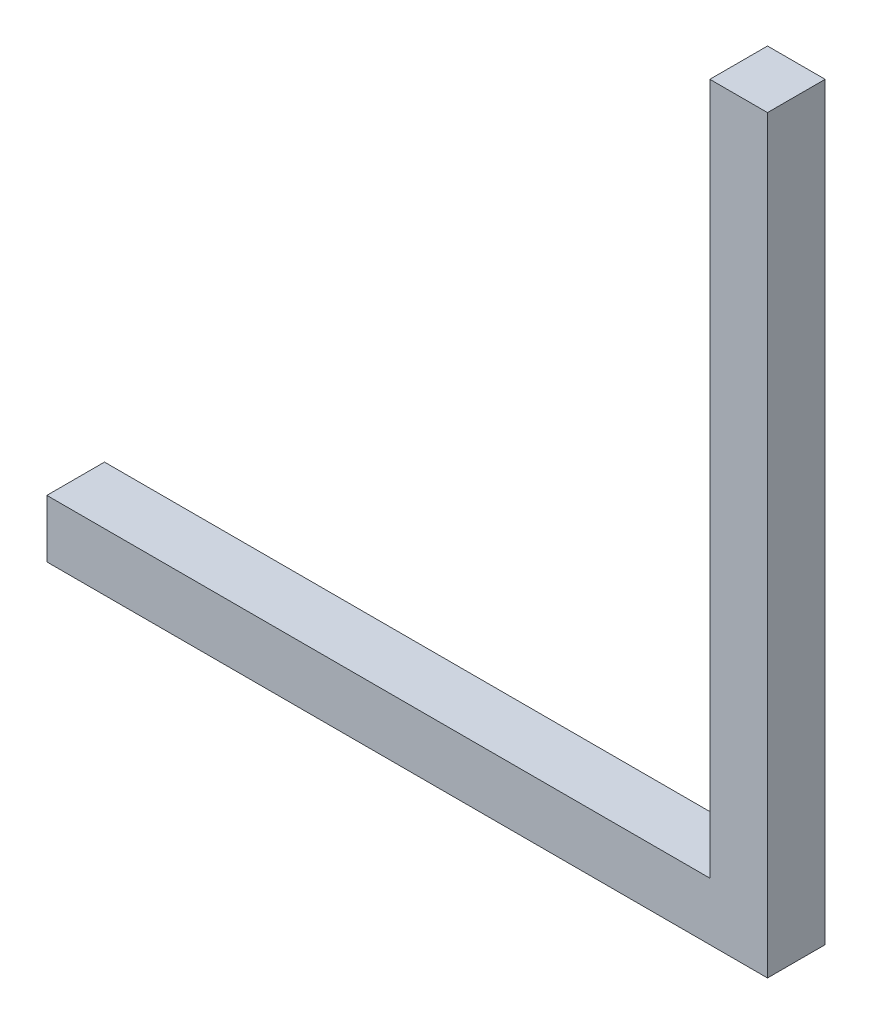
ISO-10303-21;
HEADER;
FILE_DESCRIPTION(('STEP AP214'),'2;1');
FILE_NAME('part.step','',(''),(''),'','','');
FILE_SCHEMA(('AUTOMOTIVE_DESIGN { 1 0 10303 214 1 1 1 1 }'));
ENDSEC;
DATA;
#1=APPLICATION_CONTEXT('core data for automotive mechanical design processes');
#2=APPLICATION_PROTOCOL_DEFINITION('international standard','automotive_design',2000,#1);
#3=PRODUCT_CONTEXT('',#1,'mechanical');
#4=PRODUCT('Part','Part','',(#3));
#5=PRODUCT_RELATED_PRODUCT_CATEGORY('part','',(#4));
#6=PRODUCT_DEFINITION_FORMATION('','',#4);
#7=PRODUCT_DEFINITION_CONTEXT('part definition',#1,'design');
#8=PRODUCT_DEFINITION('design','',#6,#7);
#9=PRODUCT_DEFINITION_SHAPE('','',#8);
#10=(LENGTH_UNIT() NAMED_UNIT(*) SI_UNIT(.MILLI.,.METRE.));
#11=(NAMED_UNIT(*) PLANE_ANGLE_UNIT() SI_UNIT($,.RADIAN.));
#12=(NAMED_UNIT(*) SI_UNIT($,.STERADIAN.) SOLID_ANGLE_UNIT());
#13=UNCERTAINTY_MEASURE_WITH_UNIT(LENGTH_MEASURE(1.E-05),#10,'distance_accuracy_value','');
#14=(GEOMETRIC_REPRESENTATION_CONTEXT(3) GLOBAL_UNCERTAINTY_ASSIGNED_CONTEXT((#13)) GLOBAL_UNIT_ASSIGNED_CONTEXT((#10,
#11,#12)) REPRESENTATION_CONTEXT('',''));
#15=CARTESIAN_POINT('',(0.,0.,0.));
#16=DIRECTION('',(0.,0.,1.));
#17=DIRECTION('',(1.,0.,0.));
#18=AXIS2_PLACEMENT_3D('',#15,#16,#17);
#19=CARTESIAN_POINT('',(-18.4372316471927,14.3170914790895,10.));
#20=DIRECTION('',(1.,0.,0.));
#21=DIRECTION('',(0.,0.,-1.));
#22=AXIS2_PLACEMENT_3D('',#19,#20,#21);
#23=PLANE('',#22);
#24=DIRECTION('',(0.,-1.,0.));
#25=VECTOR('',#24,1.);
#26=CARTESIAN_POINT('',(-18.4372316471927,14.3170914790895,0.));
#27=LINE('',#26,#25);
#28=CARTESIAN_POINT('',(-18.4372316471927,14.3170914790895,0.));
#29=VERTEX_POINT('',#28);
#30=CARTESIAN_POINT('',(-18.4372316471927,4.31709147908948,0.));
#31=VERTEX_POINT('',#30);
#32=EDGE_CURVE('E84',#29,#31,#27,.T.);
#33=ORIENTED_EDGE('',*,*,#32,.T.);
#34=DIRECTION('',(0.,0.,-1.));
#35=VECTOR('',#34,1.);
#36=CARTESIAN_POINT('',(-18.4372316471927,4.31709147908948,10.));
#37=LINE('',#36,#35);
#38=CARTESIAN_POINT('',(-18.4372316471927,4.31709147908948,10.));
#39=VERTEX_POINT('',#38);
#40=EDGE_CURVE('E11',#39,#31,#37,.T.);
#41=ORIENTED_EDGE('',*,*,#40,.F.);
#42=DIRECTION('',(0.,-1.,0.));
#43=VECTOR('',#42,1.);
#44=CARTESIAN_POINT('',(-18.4372316471927,14.3170914790895,10.));
#45=LINE('',#44,#43);
#46=CARTESIAN_POINT('',(-18.4372316471927,14.3170914790895,10.));
#47=VERTEX_POINT('',#46);
#48=EDGE_CURVE('E78',#47,#39,#45,.T.);
#49=ORIENTED_EDGE('',*,*,#48,.F.);
#50=DIRECTION('',(0.,0.,-1.));
#51=VECTOR('',#50,1.);
#52=CARTESIAN_POINT('',(-18.4372316471927,14.3170914790895,10.));
#53=LINE('',#52,#51);
#54=EDGE_CURVE('E74',#47,#29,#53,.T.);
#55=ORIENTED_EDGE('',*,*,#54,.T.);
#56=EDGE_LOOP('',(#33,#41,#49,#55));
#57=FACE_BOUND('',#56,.T.);
#58=ADVANCED_FACE('F33',(#57),#23,.F.);
#59=CARTESIAN_POINT('',(-18.4372316471927,4.31709147908948,10.));
#60=DIRECTION('',(0.,1.,0.));
#61=DIRECTION('',(0.,0.,1.));
#62=AXIS2_PLACEMENT_3D('',#59,#60,#61);
#63=PLANE('',#62);
#64=DIRECTION('',(1.,0.,0.));
#65=VECTOR('',#64,1.);
#66=CARTESIAN_POINT('',(-18.4372316471927,4.31709147908948,0.));
#67=LINE('',#66,#65);
#68=CARTESIAN_POINT('',(106.562768352807,4.31709147908948,0.));
#69=VERTEX_POINT('',#68);
#70=EDGE_CURVE('E79',#31,#69,#67,.T.);
#71=ORIENTED_EDGE('',*,*,#70,.T.);
#72=DIRECTION('',(0.,0.,-1.));
#73=VECTOR('',#72,1.);
#74=CARTESIAN_POINT('',(106.562768352807,4.31709147908948,0.));
#75=LINE('',#74,#73);
#76=CARTESIAN_POINT('',(106.562768352807,4.31709147908948,10.));
#77=VERTEX_POINT('',#76);
#78=EDGE_CURVE('E118',#77,#69,#75,.T.);
#79=ORIENTED_EDGE('',*,*,#78,.F.);
#80=DIRECTION('',(1.,0.,0.));
#81=VECTOR('',#80,1.);
#82=CARTESIAN_POINT('',(-18.4372316471927,4.31709147908948,10.));
#83=LINE('',#82,#81);
#84=EDGE_CURVE('E96',#39,#77,#83,.T.);
#85=ORIENTED_EDGE('',*,*,#84,.F.);
#86=ORIENTED_EDGE('',*,*,#40,.T.);
#87=EDGE_LOOP('',(#71,#79,#85,#86));
#88=FACE_BOUND('',#87,.T.);
#89=ADVANCED_FACE('F151',(#88),#63,.F.);
#90=CARTESIAN_POINT('',(-18.4372316471927,14.3170914790895,10.));
#91=DIRECTION('',(0.,-1.,0.));
#92=DIRECTION('',(0.,0.,-1.));
#93=AXIS2_PLACEMENT_3D('',#90,#91,#92);
#94=PLANE('',#93);
#95=DIRECTION('',(-1.,0.,0.));
#96=VECTOR('',#95,1.);
#97=CARTESIAN_POINT('',(-18.4372316471927,14.3170914790895,0.));
#98=LINE('',#97,#96);
#99=CARTESIAN_POINT('',(96.5627683528073,14.3170914790895,0.));
#100=VERTEX_POINT('',#99);
#101=EDGE_CURVE('E71',#100,#29,#98,.T.);
#102=ORIENTED_EDGE('',*,*,#101,.T.);
#103=ORIENTED_EDGE('',*,*,#54,.F.);
#104=DIRECTION('',(-1.,0.,0.));
#105=VECTOR('',#104,1.);
#106=CARTESIAN_POINT('',(-18.4372316471927,14.3170914790895,10.));
#107=LINE('',#106,#105);
#108=CARTESIAN_POINT('',(96.5627683528073,14.3170914790895,10.));
#109=VERTEX_POINT('',#108);
#110=EDGE_CURVE('E51',#109,#47,#107,.T.);
#111=ORIENTED_EDGE('',*,*,#110,.F.);
#112=DIRECTION('',(0.,0.,-1.));
#113=VECTOR('',#112,1.);
#114=CARTESIAN_POINT('',(96.5627683528073,14.3170914790895,10.));
#115=LINE('',#114,#113);
#116=EDGE_CURVE('E42',#109,#100,#115,.T.);
#117=ORIENTED_EDGE('',*,*,#116,.T.);
#118=EDGE_LOOP('',(#102,#103,#111,#117));
#119=FACE_BOUND('',#118,.T.);
#120=ADVANCED_FACE('F73',(#119),#94,.F.);
#121=CARTESIAN_POINT('',(0.,0.,10.));
#122=DIRECTION('',(0.,0.,1.));
#123=DIRECTION('',(1.,0.,0.));
#124=AXIS2_PLACEMENT_3D('',#121,#122,#123);
#125=PLANE('',#124);
#126=ORIENTED_EDGE('',*,*,#48,.T.);
#127=ORIENTED_EDGE('',*,*,#84,.T.);
#128=DIRECTION('',(0.,-1.,0.));
#129=VECTOR('',#128,1.);
#130=CARTESIAN_POINT('',(106.562768352807,4.31709147908948,10.));
#131=LINE('',#130,#129);
#132=CARTESIAN_POINT('',(106.562768352807,134.317091479089,10.));
#133=VERTEX_POINT('',#132);
#134=EDGE_CURVE('E123',#133,#77,#131,.T.);
#135=ORIENTED_EDGE('',*,*,#134,.F.);
#136=DIRECTION('',(-1.,0.,0.));
#137=VECTOR('',#136,1.);
#138=CARTESIAN_POINT('',(106.562768352807,134.317091479089,10.));
#139=LINE('',#138,#137);
#140=CARTESIAN_POINT('',(96.5627683528073,134.317091479089,10.));
#141=VERTEX_POINT('',#140);
#142=EDGE_CURVE('E93',#133,#141,#139,.T.);
#143=ORIENTED_EDGE('',*,*,#142,.T.);
#144=DIRECTION('',(0.,-1.,0.));
#145=VECTOR('',#144,1.);
#146=CARTESIAN_POINT('',(96.5627683528073,4.31709147908948,10.));
#147=LINE('',#146,#145);
#148=EDGE_CURVE('E108',#141,#109,#147,.T.);
#149=ORIENTED_EDGE('',*,*,#148,.T.);
#150=ORIENTED_EDGE('',*,*,#110,.T.);
#151=EDGE_LOOP('',(#126,#127,#135,#143,#149,#150));
#152=FACE_BOUND('',#151,.T.);
#153=ADVANCED_FACE('F157',(#152),#125,.T.);
#154=CARTESIAN_POINT('',(0.,0.,0.));
#155=DIRECTION('',(0.,0.,1.));
#156=DIRECTION('',(1.,0.,0.));
#157=AXIS2_PLACEMENT_3D('',#154,#155,#156);
#158=PLANE('',#157);
#159=ORIENTED_EDGE('',*,*,#32,.F.);
#160=ORIENTED_EDGE('',*,*,#101,.F.);
#161=DIRECTION('',(0.,1.,0.));
#162=VECTOR('',#161,1.);
#163=CARTESIAN_POINT('',(96.5627683528073,4.31709147908948,0.));
#164=LINE('',#163,#162);
#165=CARTESIAN_POINT('',(96.5627683528073,134.317091479089,0.));
#166=VERTEX_POINT('',#165);
#167=EDGE_CURVE('E66',#100,#166,#164,.T.);
#168=ORIENTED_EDGE('',*,*,#167,.T.);
#169=DIRECTION('',(-1.,0.,0.));
#170=VECTOR('',#169,1.);
#171=CARTESIAN_POINT('',(106.562768352807,134.317091479089,0.));
#172=LINE('',#171,#170);
#173=CARTESIAN_POINT('',(106.562768352807,134.317091479089,0.));
#174=VERTEX_POINT('',#173);
#175=EDGE_CURVE('E89',#174,#166,#172,.T.);
#176=ORIENTED_EDGE('',*,*,#175,.F.);
#177=DIRECTION('',(0.,1.,0.));
#178=VECTOR('',#177,1.);
#179=CARTESIAN_POINT('',(106.562768352807,4.31709147908948,0.));
#180=LINE('',#179,#178);
#181=EDGE_CURVE('E111',#69,#174,#180,.T.);
#182=ORIENTED_EDGE('',*,*,#181,.F.);
#183=ORIENTED_EDGE('',*,*,#70,.F.);
#184=EDGE_LOOP('',(#159,#160,#168,#176,#182,#183));
#185=FACE_BOUND('',#184,.T.);
#186=ADVANCED_FACE('F86',(#185),#158,.F.);
#187=CARTESIAN_POINT('',(106.562768352807,134.317091479089,0.));
#188=DIRECTION('',(0.,-1.,0.));
#189=DIRECTION('',(0.,0.,-1.));
#190=AXIS2_PLACEMENT_3D('',#187,#188,#189);
#191=PLANE('',#190);
#192=DIRECTION('',(0.,0.,1.));
#193=VECTOR('',#192,1.);
#194=CARTESIAN_POINT('',(96.5627683528073,134.317091479089,0.));
#195=LINE('',#194,#193);
#196=EDGE_CURVE('E112',#166,#141,#195,.T.);
#197=ORIENTED_EDGE('',*,*,#196,.T.);
#198=ORIENTED_EDGE('',*,*,#142,.F.);
#199=DIRECTION('',(0.,0.,1.));
#200=VECTOR('',#199,1.);
#201=CARTESIAN_POINT('',(106.562768352807,134.317091479089,0.));
#202=LINE('',#201,#200);
#203=EDGE_CURVE('E129',#174,#133,#202,.T.);
#204=ORIENTED_EDGE('',*,*,#203,.F.);
#205=ORIENTED_EDGE('',*,*,#175,.T.);
#206=EDGE_LOOP('',(#197,#198,#204,#205));
#207=FACE_BOUND('',#206,.T.);
#208=ADVANCED_FACE('F144',(#207),#191,.F.);
#209=CARTESIAN_POINT('',(106.562768352807,0.,0.));
#210=DIRECTION('',(1.,0.,0.));
#211=DIRECTION('',(0.,0.,-1.));
#212=AXIS2_PLACEMENT_3D('',#209,#210,#211);
#213=PLANE('',#212);
#214=ORIENTED_EDGE('',*,*,#181,.T.);
#215=ORIENTED_EDGE('',*,*,#203,.T.);
#216=ORIENTED_EDGE('',*,*,#134,.T.);
#217=ORIENTED_EDGE('',*,*,#78,.T.);
#218=EDGE_LOOP('',(#214,#215,#216,#217));
#219=FACE_BOUND('',#218,.T.);
#220=ADVANCED_FACE('F137',(#219),#213,.T.);
#221=CARTESIAN_POINT('',(96.5627683528073,0.,0.));
#222=DIRECTION('',(1.,0.,0.));
#223=DIRECTION('',(0.,0.,-1.));
#224=AXIS2_PLACEMENT_3D('',#221,#222,#223);
#225=PLANE('',#224);
#226=ORIENTED_EDGE('',*,*,#116,.F.);
#227=ORIENTED_EDGE('',*,*,#148,.F.);
#228=ORIENTED_EDGE('',*,*,#196,.F.);
#229=ORIENTED_EDGE('',*,*,#167,.F.);
#230=EDGE_LOOP('',(#226,#227,#228,#229));
#231=FACE_BOUND('',#230,.T.);
#232=ADVANCED_FACE('F166',(#231),#225,.F.);
#233=CLOSED_SHELL('',(#58,#89,#120,#153,#186,#208,#220,#232));
#234=MANIFOLD_SOLID_BREP('B2',#233);
#235=ADVANCED_BREP_SHAPE_REPRESENTATION('',(#18,#234),#14);
#236=SHAPE_DEFINITION_REPRESENTATION(#9,#235);
ENDSEC;
END-ISO-10303-21;
